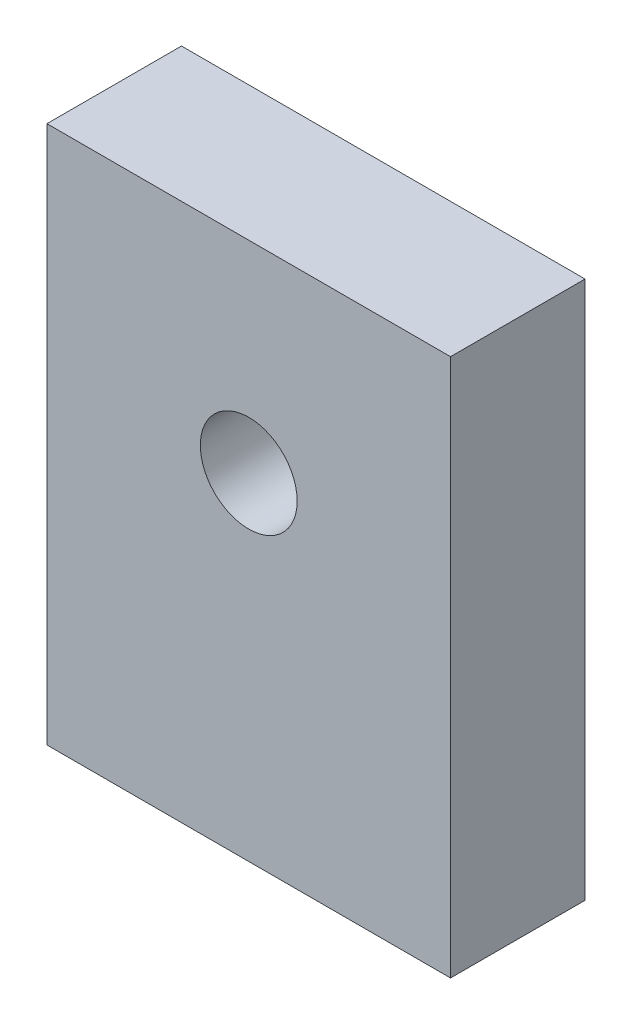
ISO-10303-21;
HEADER;
FILE_DESCRIPTION(('STEP AP214'),'2;1');
FILE_NAME('part.step','',(''),(''),'','','');
FILE_SCHEMA(('AUTOMOTIVE_DESIGN { 1 0 10303 214 1 1 1 1 }'));
ENDSEC;
DATA;
#1=APPLICATION_CONTEXT('core data for automotive mechanical design processes');
#2=APPLICATION_PROTOCOL_DEFINITION('international standard','automotive_design',2000,#1);
#3=PRODUCT_CONTEXT('',#1,'mechanical');
#4=PRODUCT('Part','Part','',(#3));
#5=PRODUCT_RELATED_PRODUCT_CATEGORY('part','',(#4));
#6=PRODUCT_DEFINITION_FORMATION('','',#4);
#7=PRODUCT_DEFINITION_CONTEXT('part definition',#1,'design');
#8=PRODUCT_DEFINITION('design','',#6,#7);
#9=PRODUCT_DEFINITION_SHAPE('','',#8);
#10=(LENGTH_UNIT() NAMED_UNIT(*) SI_UNIT(.MILLI.,.METRE.));
#11=(NAMED_UNIT(*) PLANE_ANGLE_UNIT() SI_UNIT($,.RADIAN.));
#12=(NAMED_UNIT(*) SI_UNIT($,.STERADIAN.) SOLID_ANGLE_UNIT());
#13=UNCERTAINTY_MEASURE_WITH_UNIT(LENGTH_MEASURE(1.E-05),#10,'distance_accuracy_value','');
#14=(GEOMETRIC_REPRESENTATION_CONTEXT(3) GLOBAL_UNCERTAINTY_ASSIGNED_CONTEXT((#13)) GLOBAL_UNIT_ASSIGNED_CONTEXT((#10,
#11,#12)) REPRESENTATION_CONTEXT('',''));
#15=CARTESIAN_POINT('',(0.,0.,0.));
#16=DIRECTION('',(0.,0.,1.));
#17=DIRECTION('',(1.,0.,0.));
#18=AXIS2_PLACEMENT_3D('',#15,#16,#17);
#19=CARTESIAN_POINT('',(0.,0.,6.35));
#20=DIRECTION('',(0.,0.,-1.));
#21=DIRECTION('',(-1.,0.,0.));
#22=AXIS2_PLACEMENT_3D('',#19,#20,#21);
#23=PLANE('',#22);
#24=DIRECTION('',(0.,1.,0.));
#25=VECTOR('',#24,1.);
#26=CARTESIAN_POINT('',(9.525,-10.7911171186631,6.35));
#27=LINE('',#26,#25);
#28=CARTESIAN_POINT('',(9.525,-10.7911171186631,6.35));
#29=VERTEX_POINT('',#28);
#30=CARTESIAN_POINT('',(9.525,14.6088828813369,6.35));
#31=VERTEX_POINT('',#30);
#32=EDGE_CURVE('E87',#29,#31,#27,.T.);
#33=ORIENTED_EDGE('',*,*,#32,.T.);
#34=DIRECTION('',(-1.,0.,0.));
#35=VECTOR('',#34,1.);
#36=CARTESIAN_POINT('',(-9.525,14.6088828813369,6.35));
#37=LINE('',#36,#35);
#38=CARTESIAN_POINT('',(-9.525,14.6088828813369,6.35));
#39=VERTEX_POINT('',#38);
#40=EDGE_CURVE('E82',#31,#39,#37,.T.);
#41=ORIENTED_EDGE('',*,*,#40,.T.);
#42=DIRECTION('',(0.,-1.,0.));
#43=VECTOR('',#42,1.);
#44=CARTESIAN_POINT('',(-9.525,-10.7911171186631,6.35));
#45=LINE('',#44,#43);
#46=CARTESIAN_POINT('',(-9.525,-10.7911171186631,6.35));
#47=VERTEX_POINT('',#46);
#48=EDGE_CURVE('E85',#39,#47,#45,.T.);
#49=ORIENTED_EDGE('',*,*,#48,.T.);
#50=DIRECTION('',(1.,0.,0.));
#51=VECTOR('',#50,1.);
#52=CARTESIAN_POINT('',(-9.525,-10.7911171186631,6.35));
#53=LINE('',#52,#51);
#54=EDGE_CURVE('E52',#47,#29,#53,.T.);
#55=ORIENTED_EDGE('',*,*,#54,.T.);
#56=EDGE_LOOP('',(#33,#41,#49,#55));
#57=FACE_BOUND('',#56,.T.);
#58=CARTESIAN_POINT('',(0.,5.08388288133688,6.35));
#59=DIRECTION('',(0.,0.,1.));
#60=DIRECTION('',(1.,0.,0.));
#61=AXIS2_PLACEMENT_3D('',#58,#59,#60);
#62=CIRCLE('',#61,2.286);
#63=CARTESIAN_POINT('',(2.286,5.08388288133688,6.35));
#64=VERTEX_POINT('',#63);
#65=EDGE_CURVE('E102',#64,#64,#62,.T.);
#66=ORIENTED_EDGE('',*,*,#65,.F.);
#67=EDGE_LOOP('',(#66));
#68=FACE_BOUND('',#67,.T.);
#69=ADVANCED_FACE('F35',(#57,#68),#23,.F.);
#70=CARTESIAN_POINT('',(0.,0.,0.));
#71=DIRECTION('',(0.,0.,-1.));
#72=DIRECTION('',(-1.,0.,0.));
#73=AXIS2_PLACEMENT_3D('',#70,#71,#72);
#74=PLANE('',#73);
#75=DIRECTION('',(0.,1.,0.));
#76=VECTOR('',#75,1.);
#77=CARTESIAN_POINT('',(9.525,-10.7911171186631,0.));
#78=LINE('',#77,#76);
#79=CARTESIAN_POINT('',(9.525,-10.7911171186631,0.));
#80=VERTEX_POINT('',#79);
#81=CARTESIAN_POINT('',(9.525,14.6088828813369,0.));
#82=VERTEX_POINT('',#81);
#83=EDGE_CURVE('E99',#80,#82,#78,.T.);
#84=ORIENTED_EDGE('',*,*,#83,.F.);
#85=DIRECTION('',(1.,0.,0.));
#86=VECTOR('',#85,1.);
#87=CARTESIAN_POINT('',(-9.525,-10.7911171186631,0.));
#88=LINE('',#87,#86);
#89=CARTESIAN_POINT('',(-9.525,-10.7911171186631,0.));
#90=VERTEX_POINT('',#89);
#91=EDGE_CURVE('E75',#90,#80,#88,.T.);
#92=ORIENTED_EDGE('',*,*,#91,.F.);
#93=DIRECTION('',(0.,-1.,0.));
#94=VECTOR('',#93,1.);
#95=CARTESIAN_POINT('',(-9.525,-10.7911171186631,0.));
#96=LINE('',#95,#94);
#97=CARTESIAN_POINT('',(-9.525,14.6088828813369,0.));
#98=VERTEX_POINT('',#97);
#99=EDGE_CURVE('E69',#98,#90,#96,.T.);
#100=ORIENTED_EDGE('',*,*,#99,.F.);
#101=DIRECTION('',(-1.,0.,0.));
#102=VECTOR('',#101,1.);
#103=CARTESIAN_POINT('',(-9.525,14.6088828813369,0.));
#104=LINE('',#103,#102);
#105=EDGE_CURVE('E91',#82,#98,#104,.T.);
#106=ORIENTED_EDGE('',*,*,#105,.F.);
#107=EDGE_LOOP('',(#84,#92,#100,#106));
#108=FACE_BOUND('',#107,.T.);
#109=CARTESIAN_POINT('',(0.,5.08388288133688,0.));
#110=DIRECTION('',(0.,0.,1.));
#111=DIRECTION('',(1.,0.,0.));
#112=AXIS2_PLACEMENT_3D('',#109,#110,#111);
#113=CIRCLE('',#112,2.286);
#114=CARTESIAN_POINT('',(2.286,5.08388288133688,0.));
#115=VERTEX_POINT('',#114);
#116=EDGE_CURVE('E114',#115,#115,#113,.T.);
#117=ORIENTED_EDGE('',*,*,#116,.T.);
#118=EDGE_LOOP('',(#117));
#119=FACE_BOUND('',#118,.T.);
#120=ADVANCED_FACE('F110',(#108,#119),#74,.T.);
#121=CARTESIAN_POINT('',(9.525,-10.7911171186631,6.35));
#122=DIRECTION('',(-1.,0.,0.));
#123=DIRECTION('',(0.,0.,1.));
#124=AXIS2_PLACEMENT_3D('',#121,#122,#123);
#125=PLANE('',#124);
#126=ORIENTED_EDGE('',*,*,#83,.T.);
#127=DIRECTION('',(0.,0.,-1.));
#128=VECTOR('',#127,1.);
#129=CARTESIAN_POINT('',(9.525,14.6088828813369,6.35));
#130=LINE('',#129,#128);
#131=EDGE_CURVE('E11',#31,#82,#130,.T.);
#132=ORIENTED_EDGE('',*,*,#131,.F.);
#133=ORIENTED_EDGE('',*,*,#32,.F.);
#134=DIRECTION('',(0.,0.,-1.));
#135=VECTOR('',#134,1.);
#136=CARTESIAN_POINT('',(9.525,-10.7911171186631,6.35));
#137=LINE('',#136,#135);
#138=EDGE_CURVE('E95',#29,#80,#137,.T.);
#139=ORIENTED_EDGE('',*,*,#138,.T.);
#140=EDGE_LOOP('',(#126,#132,#133,#139));
#141=FACE_BOUND('',#140,.T.);
#142=ADVANCED_FACE('F37',(#141),#125,.F.);
#143=CARTESIAN_POINT('',(-9.525,14.6088828813369,6.35));
#144=DIRECTION('',(0.,-1.,0.));
#145=DIRECTION('',(0.,0.,-1.));
#146=AXIS2_PLACEMENT_3D('',#143,#144,#145);
#147=PLANE('',#146);
#148=ORIENTED_EDGE('',*,*,#105,.T.);
#149=DIRECTION('',(0.,0.,-1.));
#150=VECTOR('',#149,1.);
#151=CARTESIAN_POINT('',(-9.525,14.6088828813369,6.35));
#152=LINE('',#151,#150);
#153=EDGE_CURVE('E44',#39,#98,#152,.T.);
#154=ORIENTED_EDGE('',*,*,#153,.F.);
#155=ORIENTED_EDGE('',*,*,#40,.F.);
#156=ORIENTED_EDGE('',*,*,#131,.T.);
#157=EDGE_LOOP('',(#148,#154,#155,#156));
#158=FACE_BOUND('',#157,.T.);
#159=ADVANCED_FACE('F90',(#158),#147,.F.);
#160=CARTESIAN_POINT('',(-9.525,-10.7911171186631,6.35));
#161=DIRECTION('',(1.,0.,0.));
#162=DIRECTION('',(0.,0.,-1.));
#163=AXIS2_PLACEMENT_3D('',#160,#161,#162);
#164=PLANE('',#163);
#165=ORIENTED_EDGE('',*,*,#99,.T.);
#166=DIRECTION('',(0.,0.,-1.));
#167=VECTOR('',#166,1.);
#168=CARTESIAN_POINT('',(-9.525,-10.7911171186631,6.35));
#169=LINE('',#168,#167);
#170=EDGE_CURVE('E92',#47,#90,#169,.T.);
#171=ORIENTED_EDGE('',*,*,#170,.F.);
#172=ORIENTED_EDGE('',*,*,#48,.F.);
#173=ORIENTED_EDGE('',*,*,#153,.T.);
#174=EDGE_LOOP('',(#165,#171,#172,#173));
#175=FACE_BOUND('',#174,.T.);
#176=ADVANCED_FACE('F93',(#175),#164,.F.);
#177=CARTESIAN_POINT('',(-9.525,-10.7911171186631,6.35));
#178=DIRECTION('',(0.,1.,0.));
#179=DIRECTION('',(0.,0.,1.));
#180=AXIS2_PLACEMENT_3D('',#177,#178,#179);
#181=PLANE('',#180);
#182=ORIENTED_EDGE('',*,*,#91,.T.);
#183=ORIENTED_EDGE('',*,*,#138,.F.);
#184=ORIENTED_EDGE('',*,*,#54,.F.);
#185=ORIENTED_EDGE('',*,*,#170,.T.);
#186=EDGE_LOOP('',(#182,#183,#184,#185));
#187=FACE_BOUND('',#186,.T.);
#188=ADVANCED_FACE('F107',(#187),#181,.F.);
#189=CARTESIAN_POINT('',(0.,5.08388288133688,6.35));
#190=DIRECTION('',(0.,0.,-1.));
#191=DIRECTION('',(-1.,0.,0.));
#192=AXIS2_PLACEMENT_3D('',#189,#190,#191);
#193=CYLINDRICAL_SURFACE('',#192,2.286);
#194=ORIENTED_EDGE('',*,*,#65,.T.);
#195=EDGE_LOOP('',(#194));
#196=FACE_BOUND('',#195,.T.);
#197=ORIENTED_EDGE('',*,*,#116,.F.);
#198=EDGE_LOOP('',(#197));
#199=FACE_BOUND('',#198,.T.);
#200=ADVANCED_FACE('F120',(#196,#199),#193,.F.);
#201=CLOSED_SHELL('',(#69,#120,#142,#159,#176,#188,#200));
#202=MANIFOLD_SOLID_BREP('B2',#201);
#203=ADVANCED_BREP_SHAPE_REPRESENTATION('',(#18,#202),#14);
#204=SHAPE_DEFINITION_REPRESENTATION(#9,#203);
ENDSEC;
END-ISO-10303-21;
